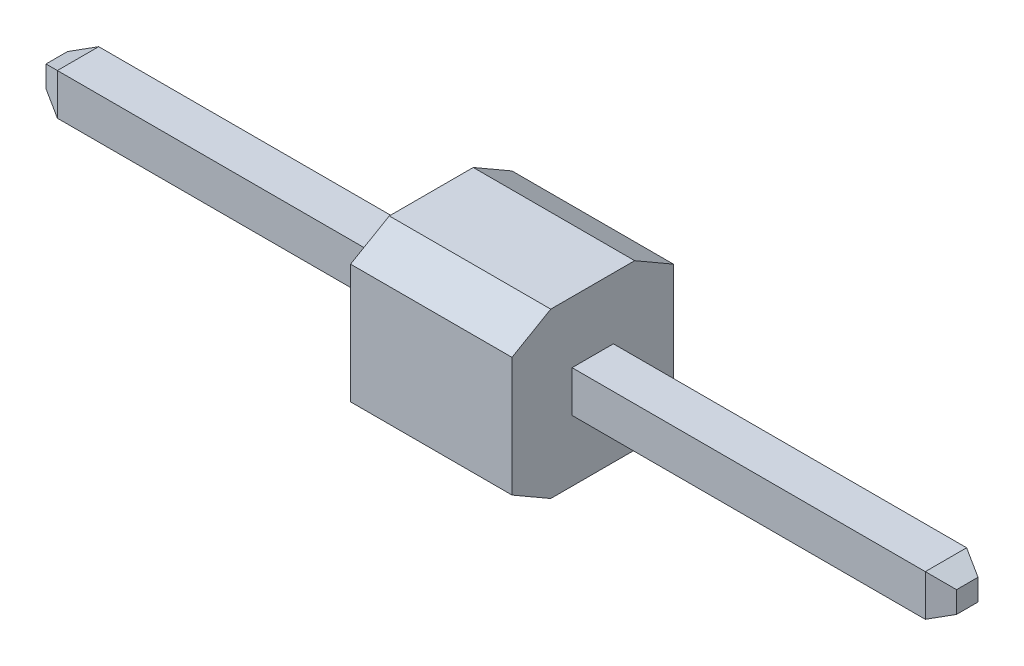
ISO-10303-21;
HEADER;
FILE_DESCRIPTION(('STEP AP214'),'2;1');
FILE_NAME('part.step','',(''),(''),'','','');
FILE_SCHEMA(('AUTOMOTIVE_DESIGN { 1 0 10303 214 1 1 1 1 }'));
ENDSEC;
DATA;
#1=APPLICATION_CONTEXT('core data for automotive mechanical design processes');
#2=APPLICATION_PROTOCOL_DEFINITION('international standard','automotive_design',2000,#1);
#3=PRODUCT_CONTEXT('',#1,'mechanical');
#4=PRODUCT('Part','Part','',(#3));
#5=PRODUCT_RELATED_PRODUCT_CATEGORY('part','',(#4));
#6=PRODUCT_DEFINITION_FORMATION('','',#4);
#7=PRODUCT_DEFINITION_CONTEXT('part definition',#1,'design');
#8=PRODUCT_DEFINITION('design','',#6,#7);
#9=PRODUCT_DEFINITION_SHAPE('','',#8);
#10=(LENGTH_UNIT() NAMED_UNIT(*) SI_UNIT(.MILLI.,.METRE.));
#11=(NAMED_UNIT(*) PLANE_ANGLE_UNIT() SI_UNIT($,.RADIAN.));
#12=(NAMED_UNIT(*) SI_UNIT($,.STERADIAN.) SOLID_ANGLE_UNIT());
#13=UNCERTAINTY_MEASURE_WITH_UNIT(LENGTH_MEASURE(1.E-05),#10,'distance_accuracy_value','');
#14=(GEOMETRIC_REPRESENTATION_CONTEXT(3) GLOBAL_UNCERTAINTY_ASSIGNED_CONTEXT((#13)) GLOBAL_UNIT_ASSIGNED_CONTEXT((#10,
#11,#12)) REPRESENTATION_CONTEXT('',''));
#15=CARTESIAN_POINT('',(0.,0.,0.));
#16=DIRECTION('',(0.,0.,1.));
#17=DIRECTION('',(1.,0.,0.));
#18=AXIS2_PLACEMENT_3D('',#15,#16,#17);
#19=CARTESIAN_POINT('',(5.42107565212665,0.317115726057139,-2.77112059556477));
#20=DIRECTION('',(1.,-9.93476518829084E-08,4.37113882867379E-08));
#21=DIRECTION('',(-9.93476589883358E-08,-1.,8.74227765734759E-08));
#22=AXIS2_PLACEMENT_3D('',#19,#20,#21);
#23=PLANE('',#22);
#24=DIRECTION('',(-1.18186632779335E-08,-0.50000007571054,-0.866025360072934));
#25=VECTOR('',#24,1.);
#26=CARTESIAN_POINT('',(5.42107545995204,-0.926473975179089,-1.20112048684669));
#27=LINE('',#26,#25);
#28=CARTESIAN_POINT('',(5.42107545995204,-0.926473975179089,-1.20112048684669));
#29=VERTEX_POINT('',#28);
#30=CARTESIAN_POINT('',(5.42107545176383,-1.27288418914276,-1.80112045656255));
#31=VERTEX_POINT('',#30);
#32=EDGE_CURVE('E11',#29,#31,#27,.T.);
#33=ORIENTED_EDGE('',*,*,#32,.T.);
#34=DIRECTION('',(4.37113811813104E-08,-8.74227828590458E-08,-0.999999999999995));
#35=VECTOR('',#34,1.);
#36=CARTESIAN_POINT('',(5.42107545176383,-1.27288418914276,-1.80112045656255));
#37=LINE('',#36,#35);
#38=CARTESIAN_POINT('',(5.42107550858862,-1.27288430279238,-3.10112045656255));
#39=VERTEX_POINT('',#38);
#40=EDGE_CURVE('E304',#31,#39,#37,.T.);
#41=ORIENTED_EDGE('',*,*,#40,.T.);
#42=DIRECTION('',(8.75289963531794E-08,0.499999924289837,-0.866025447495713));
#43=VECTOR('',#42,1.);
#44=CARTESIAN_POINT('',(5.42107550858862,-1.27288430279238,-3.10112045656255));
#45=LINE('',#44,#43);
#46=CARTESIAN_POINT('',(5.42107556923049,-0.926474193736048,-3.70112048684669));
#47=VERTEX_POINT('',#46);
#48=EDGE_CURVE('E296',#39,#47,#45,.T.);
#49=ORIENTED_EDGE('',*,*,#48,.T.);
#50=DIRECTION('',(9.93476588436478E-08,0.999999999999991,-8.74227767226935E-08));
#51=VECTOR('',#50,1.);
#52=CARTESIAN_POINT('',(5.42107556923049,-0.926474193736048,-3.70112048684669));
#53=LINE('',#52,#51);
#54=CARTESIAN_POINT('',(5.42107575274347,0.920705483233952,-3.70112064833227));
#55=VERTEX_POINT('',#54);
#56=EDGE_CURVE('E281',#47,#55,#53,.T.);
#57=ORIENTED_EDGE('',*,*,#56,.T.);
#58=DIRECTION('',(-1.18186632778483E-08,-0.500000075710537,-0.866025360072935));
#59=VECTOR('',#58,1.);
#60=CARTESIAN_POINT('',(5.42107576093168,1.26711569720762,-3.1011206786164));
#61=LINE('',#60,#59);
#62=CARTESIAN_POINT('',(5.42107576093168,1.26711569720762,-3.1011206786164));
#63=VERTEX_POINT('',#62);
#64=EDGE_CURVE('E265',#63,#55,#61,.T.);
#65=ORIENTED_EDGE('',*,*,#64,.F.);
#66=DIRECTION('',(4.37113811813104E-08,-8.74227828590458E-08,-0.999999999999995));
#67=VECTOR('',#66,1.);
#68=CARTESIAN_POINT('',(5.42107570410688,1.26711581085724,-1.8011206786164));
#69=LINE('',#68,#67);
#70=CARTESIAN_POINT('',(5.42107570410688,1.26711581085724,-1.8011206786164));
#71=VERTEX_POINT('',#70);
#72=EDGE_CURVE('E248',#71,#63,#69,.T.);
#73=ORIENTED_EDGE('',*,*,#72,.F.);
#74=DIRECTION('',(8.75289963525479E-08,0.499999924289836,-0.866025447495713));
#75=VECTOR('',#74,1.);
#76=CARTESIAN_POINT('',(5.42107564346501,0.920705701790911,-1.20112064833227));
#77=LINE('',#76,#75);
#78=CARTESIAN_POINT('',(5.42107564346501,0.920705701790911,-1.20112064833227));
#79=VERTEX_POINT('',#78);
#80=EDGE_CURVE('E242',#79,#71,#77,.T.);
#81=ORIENTED_EDGE('',*,*,#80,.F.);
#82=DIRECTION('',(9.93476588436478E-08,0.999999999999991,-8.7422776241864E-08));
#83=VECTOR('',#82,1.);
#84=CARTESIAN_POINT('',(5.42107545995204,-0.926473975179089,-1.20112048684669));
#85=LINE('',#84,#83);
#86=EDGE_CURVE('E236',#29,#79,#85,.T.);
#87=ORIENTED_EDGE('',*,*,#86,.F.);
#88=EDGE_LOOP('',(#33,#41,#49,#57,#65,#73,#81,#87));
#89=FACE_BOUND('',#88,.T.);
#90=DIRECTION('',(-4.37113803486431E-08,8.74227829017466E-08,0.999999999999995));
#91=VECTOR('',#90,1.);
#92=CARTESIAN_POINT('',(5.42107558854414,-0.32288427394286,-2.77112053961419));
#93=LINE('',#92,#91);
#94=CARTESIAN_POINT('',(5.42107558854414,-0.32288427394286,-2.77112053961419));
#95=VERTEX_POINT('',#94);
#96=CARTESIAN_POINT('',(5.42107556056886,-0.322884217992279,-2.13112053961419));
#97=VERTEX_POINT('',#96);
#98=EDGE_CURVE('E302',#95,#97,#93,.T.);
#99=ORIENTED_EDGE('',*,*,#98,.T.);
#100=DIRECTION('',(-9.93476578781121E-08,-0.999999999999991,8.7422776656742E-08));
#101=VECTOR('',#100,1.);
#102=CARTESIAN_POINT('',(5.42107562415136,0.31711578200772,-2.13112059556477));
#103=LINE('',#102,#101);
#104=CARTESIAN_POINT('',(5.42107562415136,0.31711578200772,-2.13112059556477));
#105=VERTEX_POINT('',#104);
#106=EDGE_CURVE('E293',#105,#97,#103,.T.);
#107=ORIENTED_EDGE('',*,*,#106,.F.);
#108=DIRECTION('',(-4.37113817364219E-08,8.74227829017467E-08,0.999999999999995));
#109=VECTOR('',#108,1.);
#110=CARTESIAN_POINT('',(5.42107565212665,0.317115726057139,-2.77112059556477));
#111=LINE('',#110,#109);
#112=CARTESIAN_POINT('',(5.42107565212665,0.317115726057139,-2.77112059556477));
#113=VERTEX_POINT('',#112);
#114=EDGE_CURVE('E278',#113,#105,#111,.T.);
#115=ORIENTED_EDGE('',*,*,#114,.F.);
#116=DIRECTION('',(-9.93476592658908E-08,-0.999999999999991,8.74227759628526E-08));
#117=VECTOR('',#116,1.);
#118=CARTESIAN_POINT('',(5.42107565212665,0.317115726057139,-2.77112059556477));
#119=LINE('',#118,#117);
#120=EDGE_CURVE('E263',#113,#95,#119,.T.);
#121=ORIENTED_EDGE('',*,*,#120,.T.);
#122=EDGE_LOOP('',(#99,#107,#115,#121));
#123=FACE_BOUND('',#122,.T.);
#124=ADVANCED_FACE('F17',(#89,#123),#23,.T.);
#125=CARTESIAN_POINT('',(2.92107565212665,0.317115974426269,-2.77112070484324));
#126=DIRECTION('',(1.,-9.93476518829084E-08,4.37113882867379E-08));
#127=DIRECTION('',(-9.93476589883358E-08,-1.,8.74227765734759E-08));
#128=AXIS2_PLACEMENT_3D('',#125,#126,#127);
#129=PLANE('',#128);
#130=DIRECTION('',(-1.1818662636946E-08,-0.50000007571054,-0.866025360072934));
#131=VECTOR('',#130,1.);
#132=CARTESIAN_POINT('',(2.92107545995204,-0.926473726809959,-1.20112059612516));
#133=LINE('',#132,#131);
#134=CARTESIAN_POINT('',(2.92107545995204,-0.926473726809959,-1.20112059612516));
#135=VERTEX_POINT('',#134);
#136=CARTESIAN_POINT('',(2.92107545176383,-1.27288394077363,-1.80112056584102));
#137=VERTEX_POINT('',#136);
#138=EDGE_CURVE('E24',#135,#137,#133,.T.);
#139=ORIENTED_EDGE('',*,*,#138,.F.);
#140=DIRECTION('',(9.93476590840625E-08,0.999999999999991,-8.7422776241864E-08));
#141=VECTOR('',#140,1.);
#142=CARTESIAN_POINT('',(2.92107545995204,-0.926473726809959,-1.20112059612516));
#143=LINE('',#142,#141);
#144=CARTESIAN_POINT('',(2.92107564346502,0.920705950160041,-1.20112075761074));
#145=VERTEX_POINT('',#144);
#146=EDGE_CURVE('E300',#135,#145,#143,.T.);
#147=ORIENTED_EDGE('',*,*,#146,.T.);
#148=DIRECTION('',(8.75289957115603E-08,0.499999924289836,-0.866025447495713));
#149=VECTOR('',#148,1.);
#150=CARTESIAN_POINT('',(2.92107564346502,0.920705950160041,-1.20112075761074));
#151=LINE('',#150,#149);
#152=CARTESIAN_POINT('',(2.92107570410688,1.26711605922637,-1.80112078789487));
#153=VERTEX_POINT('',#152);
#154=EDGE_CURVE('E286',#145,#153,#151,.T.);
#155=ORIENTED_EDGE('',*,*,#154,.T.);
#156=DIRECTION('',(4.37113811813104E-08,-8.74227828590458E-08,-0.999999999999995));
#157=VECTOR('',#156,1.);
#158=CARTESIAN_POINT('',(2.92107570410688,1.26711605922637,-1.80112078789487));
#159=LINE('',#158,#157);
#160=CARTESIAN_POINT('',(2.92107576093168,1.26711594557675,-3.10112078789487));
#161=VERTEX_POINT('',#160);
#162=EDGE_CURVE('E271',#153,#161,#159,.T.);
#163=ORIENTED_EDGE('',*,*,#162,.T.);
#164=DIRECTION('',(-1.18186626368607E-08,-0.500000075710537,-0.866025360072935));
#165=VECTOR('',#164,1.);
#166=CARTESIAN_POINT('',(2.92107576093168,1.26711594557675,-3.10112078789487));
#167=LINE('',#166,#165);
#168=CARTESIAN_POINT('',(2.92107575274347,0.920705731603082,-3.70112075761074));
#169=VERTEX_POINT('',#168);
#170=EDGE_CURVE('E253',#161,#169,#167,.T.);
#171=ORIENTED_EDGE('',*,*,#170,.T.);
#172=DIRECTION('',(9.93476590840625E-08,0.999999999999991,-8.74227767226935E-08));
#173=VECTOR('',#172,1.);
#174=CARTESIAN_POINT('',(2.92107556923049,-0.926473945366919,-3.70112059612516));
#175=LINE('',#174,#173);
#176=CARTESIAN_POINT('',(2.92107556923049,-0.926473945366919,-3.70112059612516));
#177=VERTEX_POINT('',#176);
#178=EDGE_CURVE('E261',#177,#169,#175,.T.);
#179=ORIENTED_EDGE('',*,*,#178,.F.);
#180=DIRECTION('',(8.75289957121919E-08,0.499999924289837,-0.866025447495713));
#181=VECTOR('',#180,1.);
#182=CARTESIAN_POINT('',(2.92107550858862,-1.27288405442325,-3.10112056584102));
#183=LINE('',#182,#181);
#184=CARTESIAN_POINT('',(2.92107550858862,-1.27288405442325,-3.10112056584102));
#185=VERTEX_POINT('',#184);
#186=EDGE_CURVE('E276',#185,#177,#183,.T.);
#187=ORIENTED_EDGE('',*,*,#186,.F.);
#188=DIRECTION('',(4.37113811813104E-08,-8.74227828590458E-08,-0.999999999999995));
#189=VECTOR('',#188,1.);
#190=CARTESIAN_POINT('',(2.92107545176383,-1.27288394077363,-1.80112056584102));
#191=LINE('',#190,#189);
#192=EDGE_CURVE('E291',#137,#185,#191,.T.);
#193=ORIENTED_EDGE('',*,*,#192,.F.);
#194=EDGE_LOOP('',(#139,#147,#155,#163,#171,#179,#187,#193));
#195=FACE_BOUND('',#194,.T.);
#196=DIRECTION('',(-9.93476592658908E-08,-0.999999999999991,8.7422776656742E-08));
#197=VECTOR('',#196,1.);
#198=CARTESIAN_POINT('',(2.92107562415136,0.31711603037685,-2.13112070484324));
#199=LINE('',#198,#197);
#200=CARTESIAN_POINT('',(2.92107562415136,0.31711603037685,-2.13112070484324));
#201=VERTEX_POINT('',#200);
#202=CARTESIAN_POINT('',(2.92107556056886,-0.322883969623149,-2.13112064889266));
#203=VERTEX_POINT('',#202);
#204=EDGE_CURVE('E298',#201,#203,#199,.T.);
#205=ORIENTED_EDGE('',*,*,#204,.T.);
#206=DIRECTION('',(-4.37113810425325E-08,8.74227829017466E-08,0.999999999999995));
#207=VECTOR('',#206,1.);
#208=CARTESIAN_POINT('',(2.92107558854414,-0.32288402557373,-2.77112064889266));
#209=LINE('',#208,#207);
#210=CARTESIAN_POINT('',(2.92107558854414,-0.32288402557373,-2.77112064889266));
#211=VERTEX_POINT('',#210);
#212=EDGE_CURVE('E283',#211,#203,#209,.T.);
#213=ORIENTED_EDGE('',*,*,#212,.F.);
#214=DIRECTION('',(-9.93476592658908E-08,-0.999999999999991,8.74227759628526E-08));
#215=VECTOR('',#214,1.);
#216=CARTESIAN_POINT('',(2.92107565212665,0.317115974426269,-2.77112070484324));
#217=LINE('',#216,#215);
#218=CARTESIAN_POINT('',(2.92107565212665,0.317115974426269,-2.77112070484324));
#219=VERTEX_POINT('',#218);
#220=EDGE_CURVE('E268',#219,#211,#217,.T.);
#221=ORIENTED_EDGE('',*,*,#220,.F.);
#222=DIRECTION('',(-4.37113810425325E-08,8.74227829017467E-08,0.999999999999995));
#223=VECTOR('',#222,1.);
#224=CARTESIAN_POINT('',(2.92107565212665,0.317115974426269,-2.77112070484324));
#225=LINE('',#224,#223);
#226=EDGE_CURVE('E251',#219,#201,#225,.T.);
#227=ORIENTED_EDGE('',*,*,#226,.T.);
#228=EDGE_LOOP('',(#205,#213,#221,#227));
#229=FACE_BOUND('',#228,.T.);
#230=ADVANCED_FACE('F314',(#195,#229),#129,.F.);
#231=CARTESIAN_POINT('',(5.42107545995204,-0.926473975179089,-1.20112048684669));
#232=DIRECTION('',(1.07893287081065E-07,0.866025360072937,-0.500000075710535));
#233=DIRECTION('',(1.18186629566715E-08,0.500000075710542,0.866025360072941));
#234=AXIS2_PLACEMENT_3D('',#231,#232,#233);
#235=PLANE('',#234);
#236=ORIENTED_EDGE('',*,*,#138,.T.);
#237=DIRECTION('',(-0.999999999999994,9.93476518829078E-08,-4.37113883755555E-08));
#238=VECTOR('',#237,1.);
#239=CARTESIAN_POINT('',(5.42107545176383,-1.27288418914276,-1.80112045656255));
#240=LINE('',#239,#238);
#241=EDGE_CURVE('E288',#31,#137,#240,.T.);
#242=ORIENTED_EDGE('',*,*,#241,.F.);
#243=ORIENTED_EDGE('',*,*,#32,.F.);
#244=DIRECTION('',(-0.999999999999994,9.93476518829078E-08,-4.3711388109102E-08));
#245=VECTOR('',#244,1.);
#246=CARTESIAN_POINT('',(5.42107545995204,-0.926473975179089,-1.20112048684669));
#247=LINE('',#246,#245);
#248=EDGE_CURVE('E256',#29,#135,#247,.T.);
#249=ORIENTED_EDGE('',*,*,#248,.T.);
#250=EDGE_LOOP('',(#236,#242,#243,#249));
#251=FACE_BOUND('',#250,.T.);
#252=ADVANCED_FACE('F306',(#251),#235,.F.);
#253=CARTESIAN_POINT('',(5.42107545176383,-1.27288418914276,-1.80112045656255));
#254=DIRECTION('',(9.93476589883358E-08,1.,-8.74227765734759E-08));
#255=DIRECTION('',(1.,-9.93476518829084E-08,4.37113882867379E-08));
#256=AXIS2_PLACEMENT_3D('',#253,#254,#255);
#257=PLANE('',#256);
#258=ORIENTED_EDGE('',*,*,#192,.T.);
#259=DIRECTION('',(-0.999999999999994,9.93476518829078E-08,-4.37113882867377E-08));
#260=VECTOR('',#259,1.);
#261=CARTESIAN_POINT('',(5.42107550858862,-1.27288430279238,-3.10112045656255));
#262=LINE('',#261,#260);
#263=EDGE_CURVE('E273',#39,#185,#262,.T.);
#264=ORIENTED_EDGE('',*,*,#263,.F.);
#265=ORIENTED_EDGE('',*,*,#40,.F.);
#266=ORIENTED_EDGE('',*,*,#241,.T.);
#267=EDGE_LOOP('',(#258,#264,#265,#266));
#268=FACE_BOUND('',#267,.T.);
#269=ADVANCED_FACE('F311',(#268),#257,.F.);
#270=CARTESIAN_POINT('',(5.42107550858862,-1.27288430279238,-3.10112045656255));
#271=DIRECTION('',(6.41819058997377E-08,0.866025447495721,0.499999924289845));
#272=DIRECTION('',(-8.7528996031702E-08,-0.499999924289838,0.866025447495717));
#273=AXIS2_PLACEMENT_3D('',#270,#271,#272);
#274=PLANE('',#273);
#275=ORIENTED_EDGE('',*,*,#186,.T.);
#276=DIRECTION('',(-0.999999999999994,9.93476518829078E-08,-4.37113884643734E-08));
#277=VECTOR('',#276,1.);
#278=CARTESIAN_POINT('',(5.42107556923049,-0.926474193736048,-3.70112048684669));
#279=LINE('',#278,#277);
#280=EDGE_CURVE('E258',#47,#177,#279,.T.);
#281=ORIENTED_EDGE('',*,*,#280,.F.);
#282=ORIENTED_EDGE('',*,*,#48,.F.);
#283=ORIENTED_EDGE('',*,*,#263,.T.);
#284=EDGE_LOOP('',(#275,#281,#282,#283));
#285=FACE_BOUND('',#284,.T.);
#286=ADVANCED_FACE('F319',(#285),#274,.F.);
#287=CARTESIAN_POINT('',(5.42107556923049,-0.926474193736048,-3.70112048684669));
#288=DIRECTION('',(-4.37113811813106E-08,8.74227836789032E-08,1.));
#289=DIRECTION('',(-1.,9.93476518829084E-08,-4.37113882867379E-08));
#290=AXIS2_PLACEMENT_3D('',#287,#288,#289);
#291=PLANE('',#290);
#292=ORIENTED_EDGE('',*,*,#178,.T.);
#293=DIRECTION('',(-0.999999999999994,9.93476533039933E-08,-4.37113882867377E-08));
#294=VECTOR('',#293,1.);
#295=CARTESIAN_POINT('',(5.42107575274347,0.920705483233952,-3.70112064833227));
#296=LINE('',#295,#294);
#297=EDGE_CURVE('E245',#55,#169,#296,.T.);
#298=ORIENTED_EDGE('',*,*,#297,.F.);
#299=ORIENTED_EDGE('',*,*,#56,.F.);
#300=ORIENTED_EDGE('',*,*,#280,.T.);
#301=EDGE_LOOP('',(#292,#298,#299,#300));
#302=FACE_BOUND('',#301,.T.);
#303=ADVANCED_FACE('F326',(#302),#291,.F.);
#304=CARTESIAN_POINT('',(5.42107576093168,1.26711569720762,-3.1011206786164));
#305=DIRECTION('',(1.07893287081065E-07,0.866025360072937,-0.500000075710535));
#306=DIRECTION('',(1.18186629566715E-08,0.500000075710542,0.866025360072941));
#307=AXIS2_PLACEMENT_3D('',#304,#305,#306);
#308=PLANE('',#307);
#309=ORIENTED_EDGE('',*,*,#170,.F.);
#310=DIRECTION('',(-0.999999999999994,9.93476511723651E-08,-4.37113882867377E-08));
#311=VECTOR('',#310,1.);
#312=CARTESIAN_POINT('',(5.42107576093168,1.26711569720762,-3.1011206786164));
#313=LINE('',#312,#311);
#314=EDGE_CURVE('E239',#63,#161,#313,.T.);
#315=ORIENTED_EDGE('',*,*,#314,.F.);
#316=ORIENTED_EDGE('',*,*,#64,.T.);
#317=ORIENTED_EDGE('',*,*,#297,.T.);
#318=EDGE_LOOP('',(#309,#315,#316,#317));
#319=FACE_BOUND('',#318,.T.);
#320=ADVANCED_FACE('F329',(#319),#308,.T.);
#321=CARTESIAN_POINT('',(5.42107570410688,1.26711581085724,-1.8011206786164));
#322=DIRECTION('',(9.93476589883358E-08,1.,-8.74227765734759E-08));
#323=DIRECTION('',(1.,-9.93476518829084E-08,4.37113882867379E-08));
#324=AXIS2_PLACEMENT_3D('',#321,#322,#323);
#325=PLANE('',#324);
#326=ORIENTED_EDGE('',*,*,#162,.F.);
#327=DIRECTION('',(-0.999999999999994,9.93476511723651E-08,-4.37113884643734E-08));
#328=VECTOR('',#327,1.);
#329=CARTESIAN_POINT('',(5.42107570410688,1.26711581085724,-1.8011206786164));
#330=LINE('',#329,#328);
#331=EDGE_CURVE('E233',#71,#153,#330,.T.);
#332=ORIENTED_EDGE('',*,*,#331,.F.);
#333=ORIENTED_EDGE('',*,*,#72,.T.);
#334=ORIENTED_EDGE('',*,*,#314,.T.);
#335=EDGE_LOOP('',(#326,#332,#333,#334));
#336=FACE_BOUND('',#335,.T.);
#337=ADVANCED_FACE('F333',(#336),#325,.T.);
#338=CARTESIAN_POINT('',(5.42107564346501,0.920705701790911,-1.20112064833227));
#339=DIRECTION('',(6.41819058997377E-08,0.866025447495721,0.499999924289845));
#340=DIRECTION('',(-8.7528996031702E-08,-0.499999924289838,0.866025447495717));
#341=AXIS2_PLACEMENT_3D('',#338,#339,#340);
#342=PLANE('',#341);
#343=ORIENTED_EDGE('',*,*,#154,.F.);
#344=DIRECTION('',(-0.999999999999994,9.93476533039933E-08,-4.3711388109102E-08));
#345=VECTOR('',#344,1.);
#346=CARTESIAN_POINT('',(5.42107564346501,0.920705701790911,-1.20112064833227));
#347=LINE('',#346,#345);
#348=EDGE_CURVE('E230',#79,#145,#347,.T.);
#349=ORIENTED_EDGE('',*,*,#348,.F.);
#350=ORIENTED_EDGE('',*,*,#80,.T.);
#351=ORIENTED_EDGE('',*,*,#331,.T.);
#352=EDGE_LOOP('',(#343,#349,#350,#351));
#353=FACE_BOUND('',#352,.T.);
#354=ADVANCED_FACE('F337',(#353),#342,.T.);
#355=CARTESIAN_POINT('',(5.42107545995204,-0.926473975179089,-1.20112048684669));
#356=DIRECTION('',(-4.37113811813106E-08,8.74227835615132E-08,1.));
#357=DIRECTION('',(-9.93476589883358E-08,-1.,8.74227764560859E-08));
#358=AXIS2_PLACEMENT_3D('',#355,#356,#357);
#359=PLANE('',#358);
#360=ORIENTED_EDGE('',*,*,#146,.F.);
#361=ORIENTED_EDGE('',*,*,#248,.F.);
#362=ORIENTED_EDGE('',*,*,#86,.T.);
#363=ORIENTED_EDGE('',*,*,#348,.T.);
#364=EDGE_LOOP('',(#360,#361,#362,#363));
#365=FACE_BOUND('',#364,.T.);
#366=ADVANCED_FACE('F339',(#365),#359,.T.);
#367=CARTESIAN_POINT('',(-2.87892434787335,0.31711655064265,-2.77112095836929));
#368=DIRECTION('',(-1.,9.93476518829084E-08,-4.37113882867379E-08));
#369=DIRECTION('',(9.93476589883358E-08,1.,-8.74227765734759E-08));
#370=AXIS2_PLACEMENT_3D('',#367,#368,#369);
#371=PLANE('',#370);
#372=DIRECTION('',(9.93476608211201E-08,0.999999999999991,-8.7422776141512E-08));
#373=VECTOR('',#372,1.);
#374=CARTESIAN_POINT('',(-2.878924417417,-0.169001879669519,-2.28500244306246));
#375=LINE('',#374,#373);
#376=CARTESIAN_POINT('',(-2.878924417417,-0.169001879669519,-2.28500244306246));
#377=VERTEX_POINT('',#376);
#378=CARTESIAN_POINT('',(-2.87892438441003,0.16323506594048,-2.28500247210754));
#379=VERTEX_POINT('',#378);
#380=EDGE_CURVE('E228',#377,#379,#375,.T.);
#381=ORIENTED_EDGE('',*,*,#380,.T.);
#382=DIRECTION('',(4.37113820547149E-08,-8.74227801493995E-08,-0.999999999999995));
#383=VECTOR('',#382,1.);
#384=CARTESIAN_POINT('',(-2.87892438441003,0.16323506594048,-2.28500247210754));
#385=LINE('',#384,#383);
#386=CARTESIAN_POINT('',(-2.8789243698875,0.163235036895403,-2.61723941772554));
#387=VERTEX_POINT('',#386);
#388=EDGE_CURVE('E223',#379,#387,#385,.T.);
#389=ORIENTED_EDGE('',*,*,#388,.T.);
#390=DIRECTION('',(-9.93476581477913E-08,-0.999999999999991,8.74227761415115E-08));
#391=VECTOR('',#390,1.);
#392=CARTESIAN_POINT('',(-2.8789243698875,0.163235036895404,-2.61723941772554));
#393=LINE('',#392,#391);
#394=CARTESIAN_POINT('',(-2.87892440289446,-0.169001908714597,-2.61723938868046));
#395=VERTEX_POINT('',#394);
#396=EDGE_CURVE('E215',#387,#395,#393,.T.);
#397=ORIENTED_EDGE('',*,*,#396,.T.);
#398=DIRECTION('',(-4.37113740347301E-08,8.7422774802743E-08,0.999999999999995));
#399=VECTOR('',#398,1.);
#400=CARTESIAN_POINT('',(-2.87892440289446,-0.169001908714597,-2.61723938868046));
#401=LINE('',#400,#399);
#402=EDGE_CURVE('E207',#395,#377,#401,.T.);
#403=ORIENTED_EDGE('',*,*,#402,.T.);
#404=EDGE_LOOP('',(#381,#389,#397,#403));
#405=FACE_BOUND('',#404,.T.);
#406=ADVANCED_FACE('F341',(#405),#371,.T.);
#407=CARTESIAN_POINT('',(-2.87892434787335,0.31711655064265,-2.77112095836929));
#408=DIRECTION('',(9.93476589883358E-08,1.,-8.74227764510112E-08));
#409=DIRECTION('',(-4.37113811813106E-08,8.74227835564385E-08,1.));
#410=AXIS2_PLACEMENT_3D('',#407,#408,#409);
#411=PLANE('',#410);
#412=DIRECTION('',(0.999999999999994,-9.93476511294987E-08,4.37113883581816E-08));
#413=VECTOR('',#412,1.);
#414=CARTESIAN_POINT('',(-2.54892434787335,0.317116517857924,-2.77112094394453));
#415=LINE('',#414,#413);
#416=CARTESIAN_POINT('',(-2.54892434787335,0.317116517857924,-2.77112094394453));
#417=VERTEX_POINT('',#416);
#418=EDGE_CURVE('E225',#417,#219,#415,.T.);
#419=ORIENTED_EDGE('',*,*,#418,.F.);
#420=DIRECTION('',(-4.37113817364219E-08,8.74227829017466E-08,0.999999999999995));
#421=VECTOR('',#420,1.);
#422=CARTESIAN_POINT('',(-2.54892434787335,0.317116517857924,-2.77112094394453));
#423=LINE('',#422,#421);
#424=CARTESIAN_POINT('',(-2.54892437584864,0.317116573808505,-2.13112094394453));
#425=VERTEX_POINT('',#424);
#426=EDGE_CURVE('E217',#417,#425,#423,.T.);
#427=ORIENTED_EDGE('',*,*,#426,.T.);
#428=DIRECTION('',(0.999999999999994,-9.93476511294987E-08,4.37113882769953E-08));
#429=VECTOR('',#428,1.);
#430=CARTESIAN_POINT('',(-2.54892437584864,0.317116573808505,-2.13112094394453));
#431=LINE('',#430,#429);
#432=EDGE_CURVE('E220',#425,#201,#431,.T.);
#433=ORIENTED_EDGE('',*,*,#432,.T.);
#434=ORIENTED_EDGE('',*,*,#226,.F.);
#435=EDGE_LOOP('',(#419,#427,#433,#434));
#436=FACE_BOUND('',#435,.T.);
#437=ADVANCED_FACE('F348',(#436),#411,.T.);
#438=CARTESIAN_POINT('',(-2.87892437584864,0.317116606593231,-2.13112095836929));
#439=DIRECTION('',(-4.37113811813106E-08,8.74227836789032E-08,1.));
#440=DIRECTION('',(-1.,9.93476518829084E-08,-4.37113882867379E-08));
#441=AXIS2_PLACEMENT_3D('',#438,#439,#440);
#442=PLANE('',#441);
#443=ORIENTED_EDGE('',*,*,#432,.F.);
#444=DIRECTION('',(-9.93476578781121E-08,-0.999999999999991,8.7422776656742E-08));
#445=VECTOR('',#444,1.);
#446=CARTESIAN_POINT('',(-2.54892437584864,0.317116573808505,-2.13112094394453));
#447=LINE('',#446,#445);
#448=CARTESIAN_POINT('',(-2.54892443943114,-0.322883426191494,-2.13112088799395));
#449=VERTEX_POINT('',#448);
#450=EDGE_CURVE('E209',#425,#449,#447,.T.);
#451=ORIENTED_EDGE('',*,*,#450,.T.);
#452=DIRECTION('',(0.999999999999994,-9.93476501552628E-08,4.3711388195809E-08));
#453=VECTOR('',#452,1.);
#454=CARTESIAN_POINT('',(-2.54892443943114,-0.322883426191494,-2.13112088799395));
#455=LINE('',#454,#453);
#456=EDGE_CURVE('E212',#449,#203,#455,.T.);
#457=ORIENTED_EDGE('',*,*,#456,.T.);
#458=ORIENTED_EDGE('',*,*,#204,.F.);
#459=EDGE_LOOP('',(#443,#451,#457,#458));
#460=FACE_BOUND('',#459,.T.);
#461=ADVANCED_FACE('F424',(#460),#442,.T.);
#462=CARTESIAN_POINT('',(-2.87892441145586,-0.322883449357349,-2.77112090241871));
#463=DIRECTION('',(9.93476589883357E-08,1.,-8.74227764040693E-08));
#464=DIRECTION('',(-4.37113811813106E-08,8.74227835094966E-08,1.));
#465=AXIS2_PLACEMENT_3D('',#462,#463,#464);
#466=PLANE('',#465);
#467=ORIENTED_EDGE('',*,*,#456,.F.);
#468=DIRECTION('',(4.37113817364219E-08,-8.74227829017466E-08,-0.999999999999995));
#469=VECTOR('',#468,1.);
#470=CARTESIAN_POINT('',(-2.54892443943114,-0.322883426191494,-2.13112088799395));
#471=LINE('',#470,#469);
#472=CARTESIAN_POINT('',(-2.54892441145586,-0.322883482142075,-2.77112088799395));
#473=VERTEX_POINT('',#472);
#474=EDGE_CURVE('E201',#449,#473,#471,.T.);
#475=ORIENTED_EDGE('',*,*,#474,.T.);
#476=DIRECTION('',(0.999999999999994,-9.93476501552628E-08,4.37113882769953E-08));
#477=VECTOR('',#476,1.);
#478=CARTESIAN_POINT('',(-2.54892441145586,-0.322883482142075,-2.77112088799395));
#479=LINE('',#478,#477);
#480=EDGE_CURVE('E204',#473,#211,#479,.T.);
#481=ORIENTED_EDGE('',*,*,#480,.T.);
#482=ORIENTED_EDGE('',*,*,#212,.T.);
#483=EDGE_LOOP('',(#467,#475,#481,#482));
#484=FACE_BOUND('',#483,.T.);
#485=ADVANCED_FACE('F421',(#484),#466,.F.);
#486=CARTESIAN_POINT('',(-2.87892434787335,0.31711655064265,-2.77112095836929));
#487=DIRECTION('',(-4.37113811813106E-08,8.74227836789032E-08,1.));
#488=DIRECTION('',(-1.,9.93476518829084E-08,-4.37113882867379E-08));
#489=AXIS2_PLACEMENT_3D('',#486,#487,#488);
#490=PLANE('',#489);
#491=ORIENTED_EDGE('',*,*,#480,.F.);
#492=DIRECTION('',(9.93476606536699E-08,0.999999999999991,-8.74227766567422E-08));
#493=VECTOR('',#492,1.);
#494=CARTESIAN_POINT('',(-2.54892441145586,-0.322883482142073,-2.77112088799395));
#495=LINE('',#494,#493);
#496=EDGE_CURVE('E196',#473,#417,#495,.T.);
#497=ORIENTED_EDGE('',*,*,#496,.T.);
#498=ORIENTED_EDGE('',*,*,#418,.T.);
#499=ORIENTED_EDGE('',*,*,#220,.T.);
#500=EDGE_LOOP('',(#491,#497,#498,#499));
#501=FACE_BOUND('',#500,.T.);
#502=ADVANCED_FACE('F376',(#501),#490,.F.);
#503=CARTESIAN_POINT('',(-2.87892434787335,0.31711655064265,-2.77112095836929));
#504=DIRECTION('',(-4.37113811813106E-08,8.74227836789032E-08,1.));
#505=DIRECTION('',(-1.,9.93476518829084E-08,-4.37113882867379E-08));
#506=AXIS2_PLACEMENT_3D('',#503,#504,#505);
#507=PLANE('',#506);
#508=DIRECTION('',(0.999999999999994,-9.93476465830644E-08,4.37113882769953E-08));
#509=VECTOR('',#508,1.);
#510=CARTESIAN_POINT('',(5.42107565212665,0.317115726057128,-2.77112059556477));
#511=LINE('',#510,#509);
#512=CARTESIAN_POINT('',(10.8910756521266,0.317115182625484,-2.77112035646347));
#513=VERTEX_POINT('',#512);
#514=EDGE_CURVE('E199',#113,#513,#511,.T.);
#515=ORIENTED_EDGE('',*,*,#514,.T.);
#516=DIRECTION('',(-9.93476578781121E-08,-0.999999999999991,8.7422776656742E-08));
#517=VECTOR('',#516,1.);
#518=CARTESIAN_POINT('',(10.8910756521266,0.317115182625484,-2.77112035646347));
#519=LINE('',#518,#517);
#520=CARTESIAN_POINT('',(10.8910755885441,-0.322884817374515,-2.7711203005129));
#521=VERTEX_POINT('',#520);
#522=EDGE_CURVE('E191',#513,#521,#519,.T.);
#523=ORIENTED_EDGE('',*,*,#522,.T.);
#524=DIRECTION('',(0.999999999999994,-9.93476517789893E-08,4.37113883581816E-08));
#525=VECTOR('',#524,1.);
#526=CARTESIAN_POINT('',(5.42107558854414,-0.322884273942858,-2.77112053961419));
#527=LINE('',#526,#525);
#528=EDGE_CURVE('E194',#95,#521,#527,.T.);
#529=ORIENTED_EDGE('',*,*,#528,.F.);
#530=ORIENTED_EDGE('',*,*,#120,.F.);
#531=EDGE_LOOP('',(#515,#523,#529,#530));
#532=FACE_BOUND('',#531,.T.);
#533=ADVANCED_FACE('F367',(#532),#507,.F.);
#534=CARTESIAN_POINT('',(-2.87892441145586,-0.322883449357349,-2.77112090241871));
#535=DIRECTION('',(9.93476589883357E-08,1.,-8.74227764040693E-08));
#536=DIRECTION('',(-4.37113811813106E-08,8.74227835094966E-08,1.));
#537=AXIS2_PLACEMENT_3D('',#534,#535,#536);
#538=PLANE('',#537);
#539=ORIENTED_EDGE('',*,*,#528,.T.);
#540=DIRECTION('',(-4.37113817364219E-08,8.74227829017467E-08,0.999999999999995));
#541=VECTOR('',#540,1.);
#542=CARTESIAN_POINT('',(10.8910755885441,-0.322884817374515,-2.7711203005129));
#543=LINE('',#542,#541);
#544=CARTESIAN_POINT('',(10.8910755605689,-0.322884761423934,-2.1311203005129));
#545=VERTEX_POINT('',#544);
#546=EDGE_CURVE('E186',#521,#545,#543,.T.);
#547=ORIENTED_EDGE('',*,*,#546,.T.);
#548=DIRECTION('',(0.999999999999994,-9.93476517789893E-08,4.3711388195809E-08));
#549=VECTOR('',#548,1.);
#550=CARTESIAN_POINT('',(5.42107556056886,-0.322884217992277,-2.13112053961419));
#551=LINE('',#550,#549);
#552=EDGE_CURVE('E189',#97,#545,#551,.T.);
#553=ORIENTED_EDGE('',*,*,#552,.F.);
#554=ORIENTED_EDGE('',*,*,#98,.F.);
#555=EDGE_LOOP('',(#539,#547,#553,#554));
#556=FACE_BOUND('',#555,.T.);
#557=ADVANCED_FACE('F364',(#556),#538,.F.);
#558=CARTESIAN_POINT('',(-2.87892437584864,0.317116606593231,-2.13112095836929));
#559=DIRECTION('',(-4.37113811813106E-08,8.74227836789032E-08,1.));
#560=DIRECTION('',(-1.,9.93476518829084E-08,-4.37113882867379E-08));
#561=AXIS2_PLACEMENT_3D('',#558,#559,#560);
#562=PLANE('',#561);
#563=ORIENTED_EDGE('',*,*,#552,.T.);
#564=DIRECTION('',(9.93476578781123E-08,0.999999999999991,-8.74227766567422E-08));
#565=VECTOR('',#564,1.);
#566=CARTESIAN_POINT('',(10.8910755605689,-0.322884761423932,-2.1311203005129));
#567=LINE('',#566,#565);
#568=CARTESIAN_POINT('',(10.8910756241514,0.317115238576065,-2.13112035646347));
#569=VERTEX_POINT('',#568);
#570=EDGE_CURVE('E176',#545,#569,#567,.T.);
#571=ORIENTED_EDGE('',*,*,#570,.T.);
#572=DIRECTION('',(0.999999999999994,-9.93476465830644E-08,4.37113880334363E-08));
#573=VECTOR('',#572,1.);
#574=CARTESIAN_POINT('',(5.42107562415136,0.31711578200771,-2.13112059556477));
#575=LINE('',#574,#573);
#576=EDGE_CURVE('E179',#105,#569,#575,.T.);
#577=ORIENTED_EDGE('',*,*,#576,.F.);
#578=ORIENTED_EDGE('',*,*,#106,.T.);
#579=EDGE_LOOP('',(#563,#571,#577,#578));
#580=FACE_BOUND('',#579,.T.);
#581=ADVANCED_FACE('F366',(#580),#562,.T.);
#582=CARTESIAN_POINT('',(-2.87892434787335,0.31711655064265,-2.77112095836929));
#583=DIRECTION('',(9.93476589883358E-08,1.,-8.74227764510112E-08));
#584=DIRECTION('',(-4.37113811813106E-08,8.74227835564385E-08,1.));
#585=AXIS2_PLACEMENT_3D('',#582,#583,#584);
#586=PLANE('',#585);
#587=ORIENTED_EDGE('',*,*,#576,.T.);
#588=DIRECTION('',(4.37113789608643E-08,-8.74227829017467E-08,-0.999999999999995));
#589=VECTOR('',#588,1.);
#590=CARTESIAN_POINT('',(10.8910756241514,0.317115238576065,-2.13112035646347));
#591=LINE('',#590,#589);
#592=EDGE_CURVE('E167',#569,#513,#591,.T.);
#593=ORIENTED_EDGE('',*,*,#592,.T.);
#594=ORIENTED_EDGE('',*,*,#514,.F.);
#595=ORIENTED_EDGE('',*,*,#114,.T.);
#596=EDGE_LOOP('',(#587,#593,#594,#595));
#597=FACE_BOUND('',#596,.T.);
#598=ADVANCED_FACE('F373',(#597),#586,.T.);
#599=CARTESIAN_POINT('',(11.2210756521266,0.317115149840758,-2.77112034203871));
#600=DIRECTION('',(-1.,9.93476518829084E-08,-4.37113882867379E-08));
#601=DIRECTION('',(9.93476589883358E-08,1.,-8.74227765734759E-08));
#602=AXIS2_PLACEMENT_3D('',#599,#600,#601);
#603=PLANE('',#602);
#604=DIRECTION('',(-9.93476581477913E-08,-0.999999999999991,8.74227761415115E-08));
#605=VECTOR('',#604,1.);
#606=CARTESIAN_POINT('',(11.22107561559,0.16323366513859,-2.28500185577696));
#607=LINE('',#606,#605);
#608=CARTESIAN_POINT('',(11.22107561559,0.163233665138588,-2.28500185577696));
#609=VERTEX_POINT('',#608);
#610=CARTESIAN_POINT('',(11.221075582583,-0.169003280471411,-2.28500182673189));
#611=VERTEX_POINT('',#610);
#612=EDGE_CURVE('E153',#609,#611,#607,.T.);
#613=ORIENTED_EDGE('',*,*,#612,.T.);
#614=DIRECTION('',(4.37113820547149E-08,-8.74227801493995E-08,-0.999999999999995));
#615=VECTOR('',#614,1.);
#616=CARTESIAN_POINT('',(11.221075582583,-0.169003280471411,-2.28500182673189));
#617=LINE('',#616,#615);
#618=CARTESIAN_POINT('',(11.2210755971055,-0.169003309516489,-2.61723877234989));
#619=VERTEX_POINT('',#618);
#620=EDGE_CURVE('E395',#611,#619,#617,.T.);
#621=ORIENTED_EDGE('',*,*,#620,.T.);
#622=DIRECTION('',(9.93476581477919E-08,0.999999999999991,-8.74227774781761E-08));
#623=VECTOR('',#622,1.);
#624=CARTESIAN_POINT('',(11.2210755971055,-0.169003309516489,-2.61723877234989));
#625=LINE('',#624,#623);
#626=CARTESIAN_POINT('',(11.2210756301125,0.16323363609351,-2.61723880139496));
#627=VERTEX_POINT('',#626);
#628=EDGE_CURVE('E156',#619,#627,#625,.T.);
#629=ORIENTED_EDGE('',*,*,#628,.T.);
#630=DIRECTION('',(-4.37113874013715E-08,8.7422774802743E-08,0.999999999999995));
#631=VECTOR('',#630,1.);
#632=CARTESIAN_POINT('',(11.2210756301125,0.16323363609351,-2.61723880139496));
#633=LINE('',#632,#631);
#634=EDGE_CURVE('E149',#627,#609,#633,.T.);
#635=ORIENTED_EDGE('',*,*,#634,.T.);
#636=EDGE_LOOP('',(#613,#621,#629,#635));
#637=FACE_BOUND('',#636,.T.);
#638=ADVANCED_FACE('F151',(#637),#603,.F.);
#639=CARTESIAN_POINT('',(-2.87892439616809,-0.169001922167348,-2.77112091587146));
#640=DIRECTION('',(-0.422618351780369,-0.906307745050466,6.07587120833484E-08));
#641=DIRECTION('',(4.37113811813106E-08,-8.74227835094966E-08,-1.));
#642=AXIS2_PLACEMENT_3D('',#639,#640,#641);
#643=PLANE('',#642);
#644=DIRECTION('',(0.83481707378875,-0.38928166954004,0.389281691158097));
#645=VECTOR('',#644,1.);
#646=CARTESIAN_POINT('',(-2.87892441741701,-0.169001879670038,-2.28500244306295));
#647=LINE('',#646,#645);
#648=EDGE_CURVE('E181',#377,#449,#647,.T.);
#649=ORIENTED_EDGE('',*,*,#648,.F.);
#650=ORIENTED_EDGE('',*,*,#402,.F.);
#651=DIRECTION('',(-0.834817107820821,0.389281737604208,0.389281550111906));
#652=VECTOR('',#651,1.);
#653=CARTESIAN_POINT('',(-2.54892441145629,-0.322883482143537,-2.77112088799342));
#654=LINE('',#653,#652);
#655=EDGE_CURVE('E404',#473,#395,#654,.T.);
#656=ORIENTED_EDGE('',*,*,#655,.F.);
#657=ORIENTED_EDGE('',*,*,#474,.F.);
#658=EDGE_LOOP('',(#649,#650,#656,#657));
#659=FACE_BOUND('',#658,.T.);
#660=ADVANCED_FACE('F418',(#659),#643,.T.);
#661=CARTESIAN_POINT('',(-2.87892435459973,0.317116564095402,-2.61723943117829));
#662=DIRECTION('',(-0.422618222124847,-3.72458176658199E-08,-0.906307805509828));
#663=DIRECTION('',(9.93476589883358E-08,1.,-8.74227765734759E-08));
#664=AXIS2_PLACEMENT_3D('',#661,#662,#663);
#665=PLANE('',#664);
#666=ORIENTED_EDGE('',*,*,#655,.T.);
#667=ORIENTED_EDGE('',*,*,#396,.F.);
#668=DIRECTION('',(-0.834817185169257,-0.389281503665795,0.389281618176065));
#669=VECTOR('',#668,1.);
#670=CARTESIAN_POINT('',(-2.54892434787221,0.317116517855197,-2.7711209439448));
#671=LINE('',#670,#669);
#672=EDGE_CURVE('E160',#417,#387,#671,.T.);
#673=ORIENTED_EDGE('',*,*,#672,.F.);
#674=ORIENTED_EDGE('',*,*,#496,.F.);
#675=EDGE_LOOP('',(#666,#667,#673,#674));
#676=FACE_BOUND('',#675,.T.);
#677=ADVANCED_FACE('F434',(#676),#665,.T.);
#678=CARTESIAN_POINT('',(-2.54892437584864,0.317116573808505,-2.13112094394453));
#679=DIRECTION('',(0.422618301356777,-1.21218081559392E-07,-0.906307768563367));
#680=DIRECTION('',(-9.93476589883358E-08,-1.,8.74227765734759E-08));
#681=AXIS2_PLACEMENT_3D('',#678,#679,#680);
#682=PLANE('',#681);
#683=ORIENTED_EDGE('',*,*,#648,.T.);
#684=ORIENTED_EDGE('',*,*,#450,.F.);
#685=DIRECTION('',(0.834817151137182,0.389281571729963,0.389281623093935));
#686=VECTOR('',#685,1.);
#687=CARTESIAN_POINT('',(-2.87892438441287,0.163235065948019,-2.285002472109));
#688=LINE('',#687,#686);
#689=EDGE_CURVE('E170',#379,#425,#688,.T.);
#690=ORIENTED_EDGE('',*,*,#689,.F.);
#691=ORIENTED_EDGE('',*,*,#380,.F.);
#692=EDGE_LOOP('',(#683,#684,#690,#691));
#693=FACE_BOUND('',#692,.T.);
#694=ADVANCED_FACE('F413',(#693),#682,.F.);
#695=CARTESIAN_POINT('',(-2.54892434787335,0.317116517857924,-2.77112094394453));
#696=DIRECTION('',(0.422618171701255,-0.906307829022729,9.770517399793E-08));
#697=DIRECTION('',(-4.37113811813106E-08,8.74227835564385E-08,1.));
#698=AXIS2_PLACEMENT_3D('',#695,#696,#697);
#699=PLANE('',#698);
#700=ORIENTED_EDGE('',*,*,#672,.T.);
#701=ORIENTED_EDGE('',*,*,#388,.F.);
#702=ORIENTED_EDGE('',*,*,#689,.T.);
#703=ORIENTED_EDGE('',*,*,#426,.F.);
#704=EDGE_LOOP('',(#700,#701,#702,#703));
#705=FACE_BOUND('',#704,.T.);
#706=ADVANCED_FACE('F429',(#705),#699,.F.);
#707=CARTESIAN_POINT('',(11.2210756368389,0.163233622640758,-2.77112032858596));
#708=DIRECTION('',(0.422618351780369,0.906307745050466,-6.07587121258922E-08));
#709=DIRECTION('',(4.37113811813106E-08,-8.74227835564385E-08,-1.));
#710=AXIS2_PLACEMENT_3D('',#707,#708,#709);
#711=PLANE('',#710);
#712=DIRECTION('',(-0.834817107820822,0.389281737604207,0.389281550111905));
#713=VECTOR('',#712,1.);
#714=CARTESIAN_POINT('',(11.22107561559,0.163233665139106,-2.28500185577745));
#715=LINE('',#714,#713);
#716=EDGE_CURVE('E164',#609,#569,#715,.T.);
#717=ORIENTED_EDGE('',*,*,#716,.F.);
#718=ORIENTED_EDGE('',*,*,#634,.F.);
#719=DIRECTION('',(0.834817073788749,-0.389281669540042,0.389281691158097));
#720=VECTOR('',#719,1.);
#721=CARTESIAN_POINT('',(10.8910756521266,0.317115182625484,-2.77112035646347));
#722=LINE('',#721,#720);
#723=EDGE_CURVE('E392',#513,#627,#722,.T.);
#724=ORIENTED_EDGE('',*,*,#723,.F.);
#725=ORIENTED_EDGE('',*,*,#592,.F.);
#726=EDGE_LOOP('',(#717,#718,#724,#725));
#727=FACE_BOUND('',#726,.T.);
#728=ADVANCED_FACE('F165',(#727),#711,.T.);
#729=CARTESIAN_POINT('',(10.8910756521266,0.317115182625484,-2.77112035646347));
#730=DIRECTION('',(-0.422618301356777,1.21218081559392E-07,0.906307768563367));
#731=DIRECTION('',(-9.93476589883358E-08,-1.,8.74227765734759E-08));
#732=AXIS2_PLACEMENT_3D('',#729,#730,#731);
#733=PLANE('',#732);
#734=ORIENTED_EDGE('',*,*,#723,.T.);
#735=ORIENTED_EDGE('',*,*,#628,.F.);
#736=DIRECTION('',(0.834817151137185,0.389281571729958,0.389281623093936));
#737=VECTOR('',#736,1.);
#738=CARTESIAN_POINT('',(10.8910755885457,-0.322884817378723,-2.77112030051199));
#739=LINE('',#738,#737);
#740=EDGE_CURVE('E389',#521,#619,#739,.T.);
#741=ORIENTED_EDGE('',*,*,#740,.F.);
#742=ORIENTED_EDGE('',*,*,#522,.F.);
#743=EDGE_LOOP('',(#734,#735,#741,#742));
#744=FACE_BOUND('',#743,.T.);
#745=ADVANCED_FACE('F390',(#744),#733,.F.);
#746=CARTESIAN_POINT('',(11.2210756308777,0.317115192338587,-2.28500186922971));
#747=DIRECTION('',(0.422618222124847,3.72458176658199E-08,0.906307805509828));
#748=DIRECTION('',(9.93476589883358E-08,1.,-8.74227765734759E-08));
#749=AXIS2_PLACEMENT_3D('',#746,#747,#748);
#750=PLANE('',#749);
#751=ORIENTED_EDGE('',*,*,#716,.T.);
#752=ORIENTED_EDGE('',*,*,#570,.F.);
#753=DIRECTION('',(-0.834817185169257,-0.389281503665796,0.389281618176065));
#754=VECTOR('',#753,1.);
#755=CARTESIAN_POINT('',(11.221075582583,-0.169003280471928,-2.28500182673237));
#756=LINE('',#755,#754);
#757=EDGE_CURVE('E175',#611,#545,#756,.T.);
#758=ORIENTED_EDGE('',*,*,#757,.F.);
#759=ORIENTED_EDGE('',*,*,#612,.F.);
#760=EDGE_LOOP('',(#751,#752,#758,#759));
#761=FACE_BOUND('',#760,.T.);
#762=ADVANCED_FACE('F173',(#761),#750,.T.);
#763=CARTESIAN_POINT('',(10.8910755885441,-0.322884817374515,-2.7711203005129));
#764=DIRECTION('',(-0.422618171701255,0.906307829022729,-9.77051739553862E-08));
#765=DIRECTION('',(-4.37113811813106E-08,8.74227835094966E-08,1.));
#766=AXIS2_PLACEMENT_3D('',#763,#764,#765);
#767=PLANE('',#766);
#768=ORIENTED_EDGE('',*,*,#740,.T.);
#769=ORIENTED_EDGE('',*,*,#620,.F.);
#770=ORIENTED_EDGE('',*,*,#757,.T.);
#771=ORIENTED_EDGE('',*,*,#546,.F.);
#772=EDGE_LOOP('',(#768,#769,#770,#771));
#773=FACE_BOUND('',#772,.T.);
#774=ADVANCED_FACE('F394',(#773),#767,.F.);
#775=CLOSED_SHELL('',(#124,#230,#252,#269,#286,#303,#320,#337,#354,#366,#406,#437,#461,#485,
#502,#533,#557,#581,#598,#638,#660,#677,#694,#706,#728,#745,#762,#774));
#776=MANIFOLD_SOLID_BREP('B1',#775);
#777=ADVANCED_BREP_SHAPE_REPRESENTATION('',(#18,#776),#14);
#778=SHAPE_DEFINITION_REPRESENTATION(#9,#777);
ENDSEC;
END-ISO-10303-21;
